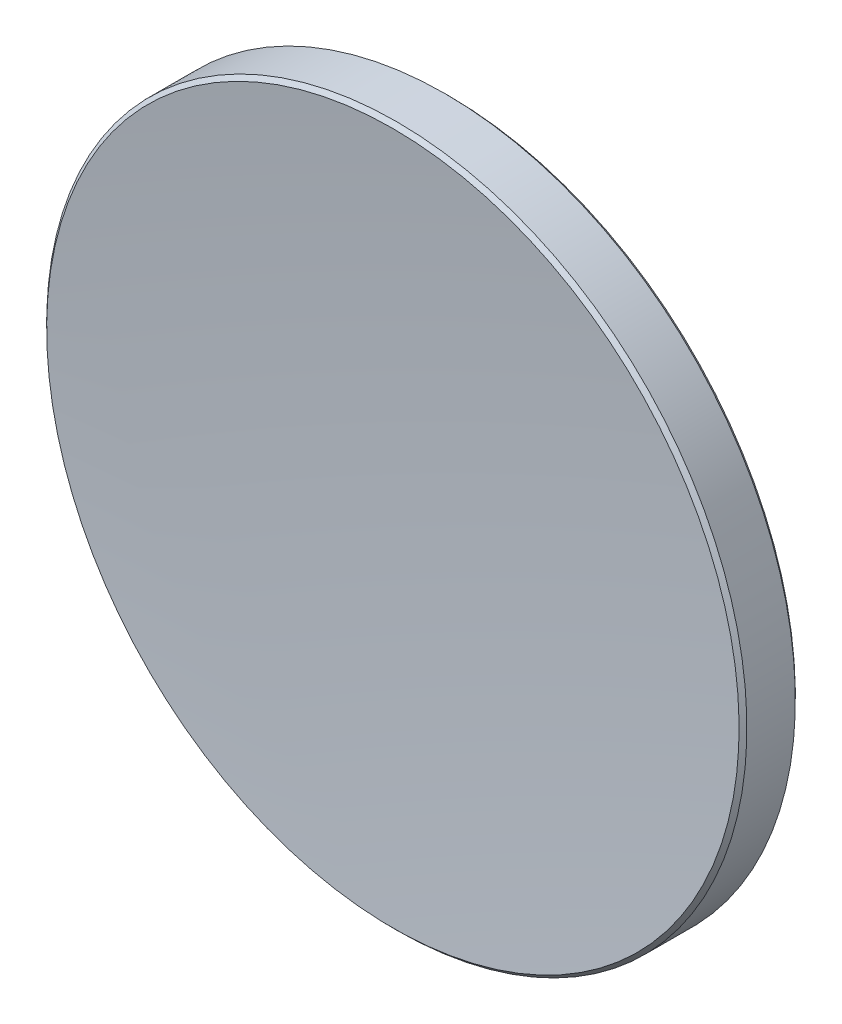
ISO-10303-21;
HEADER;
FILE_DESCRIPTION(('STEP AP214'),'2;1');
FILE_NAME('part.step','',(''),(''),'','','');
FILE_SCHEMA(('AUTOMOTIVE_DESIGN { 1 0 10303 214 1 1 1 1 }'));
ENDSEC;
DATA;
#1=APPLICATION_CONTEXT('core data for automotive mechanical design processes');
#2=APPLICATION_PROTOCOL_DEFINITION('international standard','automotive_design',2000,#1);
#3=PRODUCT_CONTEXT('',#1,'mechanical');
#4=PRODUCT('Part','Part','',(#3));
#5=PRODUCT_RELATED_PRODUCT_CATEGORY('part','',(#4));
#6=PRODUCT_DEFINITION_FORMATION('','',#4);
#7=PRODUCT_DEFINITION_CONTEXT('part definition',#1,'design');
#8=PRODUCT_DEFINITION('design','',#6,#7);
#9=PRODUCT_DEFINITION_SHAPE('','',#8);
#10=(LENGTH_UNIT() NAMED_UNIT(*) SI_UNIT(.MILLI.,.METRE.));
#11=(NAMED_UNIT(*) PLANE_ANGLE_UNIT() SI_UNIT($,.RADIAN.));
#12=(NAMED_UNIT(*) SI_UNIT($,.STERADIAN.) SOLID_ANGLE_UNIT());
#13=UNCERTAINTY_MEASURE_WITH_UNIT(LENGTH_MEASURE(1.E-05),#10,'distance_accuracy_value','');
#14=(GEOMETRIC_REPRESENTATION_CONTEXT(3) GLOBAL_UNCERTAINTY_ASSIGNED_CONTEXT((#13)) GLOBAL_UNIT_ASSIGNED_CONTEXT((#10,
#11,#12)) REPRESENTATION_CONTEXT('',''));
#15=CARTESIAN_POINT('',(0.,0.,0.));
#16=DIRECTION('',(0.,0.,1.));
#17=DIRECTION('',(1.,0.,0.));
#18=AXIS2_PLACEMENT_3D('',#15,#16,#17);
#19=CARTESIAN_POINT('',(0.,0.,151.4));
#20=DIRECTION('',(0.,0.,-1.));
#21=DIRECTION('',(0.,1.,0.));
#22=AXIS2_PLACEMENT_3D('',#19,#20,#21);
#23=SPHERICAL_SURFACE('',#22,149.8);
#24=CARTESIAN_POINT('',(0.,0.,2.12735648335147));
#25=DIRECTION('',(0.,0.,-1.));
#26=DIRECTION('',(0.,1.,0.));
#27=AXIS2_PLACEMENT_3D('',#24,#25,#26);
#28=CIRCLE('',#27,12.5585786437627);
#29=CARTESIAN_POINT('',(0.,12.5585786437627,2.12735648335147));
#30=VERTEX_POINT('',#29);
#31=EDGE_CURVE('E27',#30,#30,#28,.T.);
#32=ORIENTED_EDGE('',*,*,#31,.F.);
#33=EDGE_LOOP('',(#32));
#34=FACE_BOUND('',#33,.T.);
#35=ADVANCED_FACE('F13',(#34),#23,.F.);
#36=CARTESIAN_POINT('',(0.,0.,46.));
#37=DIRECTION('',(0.,0.,-1.));
#38=DIRECTION('',(0.,1.,0.));
#39=AXIS2_PLACEMENT_3D('',#36,#37,#38);
#40=SPHERICAL_SURFACE('',#39,47.6);
#41=CARTESIAN_POINT('',(0.,0.,0.0865803664285153));
#42=DIRECTION('',(0.,0.,-1.));
#43=DIRECTION('',(0.,1.,0.));
#44=AXIS2_PLACEMENT_3D('',#41,#42,#43);
#45=CIRCLE('',#44,12.5585786437627);
#46=CARTESIAN_POINT('',(0.,12.5585786437627,0.0865803664285153));
#47=VERTEX_POINT('',#46);
#48=EDGE_CURVE('E9',#47,#47,#45,.T.);
#49=ORIENTED_EDGE('',*,*,#48,.T.);
#50=EDGE_LOOP('',(#49));
#51=FACE_BOUND('',#50,.T.);
#52=ADVANCED_FACE('F37',(#51),#40,.T.);
#53=CARTESIAN_POINT('',(0.,0.,0.0865803664285153));
#54=DIRECTION('',(0.,0.,1.));
#55=DIRECTION('',(0.,-1.,0.));
#56=AXIS2_PLACEMENT_3D('',#53,#54,#55);
#57=CONICAL_SURFACE('',#56,12.5585786437627,0.785398163397468);
#58=CARTESIAN_POINT('',(0.,0.,0.228001722665823));
#59=DIRECTION('',(0.,0.,-1.));
#60=DIRECTION('',(0.,1.,0.));
#61=AXIS2_PLACEMENT_3D('',#58,#59,#60);
#62=CIRCLE('',#61,12.7);
#63=CARTESIAN_POINT('',(0.,12.7,0.228001722665823));
#64=VERTEX_POINT('',#63);
#65=EDGE_CURVE('E19',#64,#64,#62,.T.);
#66=ORIENTED_EDGE('',*,*,#65,.T.);
#67=EDGE_LOOP('',(#66));
#68=FACE_BOUND('',#67,.T.);
#69=ORIENTED_EDGE('',*,*,#48,.F.);
#70=EDGE_LOOP('',(#69));
#71=FACE_BOUND('',#70,.T.);
#72=ADVANCED_FACE('F43',(#68,#71),#57,.T.);
#73=CARTESIAN_POINT('',(0.,0.,-1.6));
#74=DIRECTION('',(0.,0.,-1.));
#75=DIRECTION('',(0.,1.,0.));
#76=AXIS2_PLACEMENT_3D('',#73,#74,#75);
#77=CYLINDRICAL_SURFACE('',#76,12.7);
#78=CARTESIAN_POINT('',(0.,0.,1.98593512711416));
#79=DIRECTION('',(0.,0.,-1.));
#80=DIRECTION('',(0.,1.,0.));
#81=AXIS2_PLACEMENT_3D('',#78,#79,#80);
#82=CIRCLE('',#81,12.7);
#83=CARTESIAN_POINT('',(0.,12.7,1.98593512711416));
#84=VERTEX_POINT('',#83);
#85=EDGE_CURVE('E23',#84,#84,#82,.T.);
#86=ORIENTED_EDGE('',*,*,#85,.T.);
#87=EDGE_LOOP('',(#86));
#88=FACE_BOUND('',#87,.T.);
#89=ORIENTED_EDGE('',*,*,#65,.F.);
#90=EDGE_LOOP('',(#89));
#91=FACE_BOUND('',#90,.T.);
#92=ADVANCED_FACE('F48',(#88,#91),#77,.T.);
#93=CARTESIAN_POINT('',(0.,0.,1.98593512711416));
#94=DIRECTION('',(0.,0.,-1.));
#95=DIRECTION('',(0.,1.,0.));
#96=AXIS2_PLACEMENT_3D('',#93,#94,#95);
#97=CONICAL_SURFACE('',#96,12.7,0.785398163397457);
#98=ORIENTED_EDGE('',*,*,#31,.T.);
#99=EDGE_LOOP('',(#98));
#100=FACE_BOUND('',#99,.T.);
#101=ORIENTED_EDGE('',*,*,#85,.F.);
#102=EDGE_LOOP('',(#101));
#103=FACE_BOUND('',#102,.T.);
#104=ADVANCED_FACE('F33',(#100,#103),#97,.T.);
#105=CLOSED_SHELL('',(#35,#52,#72,#92,#104));
#106=MANIFOLD_SOLID_BREP('B1',#105);
#107=ADVANCED_BREP_SHAPE_REPRESENTATION('',(#18,#106),#14);
#108=SHAPE_DEFINITION_REPRESENTATION(#9,#107);
ENDSEC;
END-ISO-10303-21;
